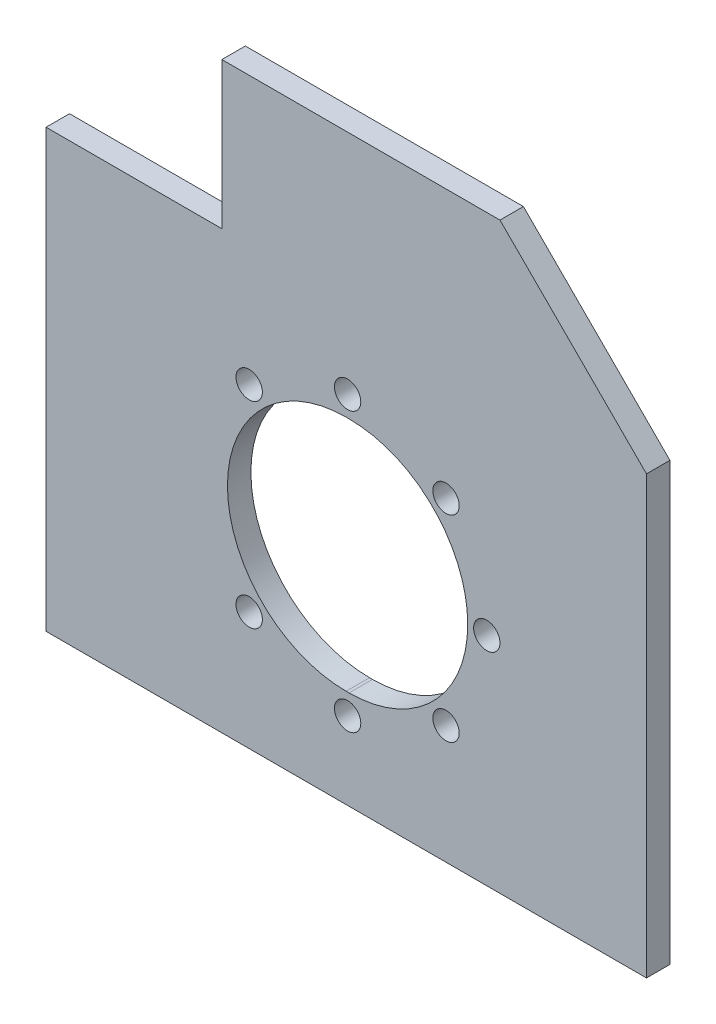
ISO-10303-21;
HEADER;
FILE_DESCRIPTION(('STEP AP214'),'2;1');
FILE_NAME('part.step','',(''),(''),'','','');
FILE_SCHEMA(('AUTOMOTIVE_DESIGN { 1 0 10303 214 1 1 1 1 }'));
ENDSEC;
DATA;
#1=APPLICATION_CONTEXT('core data for automotive mechanical design processes');
#2=APPLICATION_PROTOCOL_DEFINITION('international standard','automotive_design',2000,#1);
#3=PRODUCT_CONTEXT('',#1,'mechanical');
#4=PRODUCT('Part','Part','',(#3));
#5=PRODUCT_RELATED_PRODUCT_CATEGORY('part','',(#4));
#6=PRODUCT_DEFINITION_FORMATION('','',#4);
#7=PRODUCT_DEFINITION_CONTEXT('part definition',#1,'design');
#8=PRODUCT_DEFINITION('design','',#6,#7);
#9=PRODUCT_DEFINITION_SHAPE('','',#8);
#10=(LENGTH_UNIT() NAMED_UNIT(*) SI_UNIT(.MILLI.,.METRE.));
#11=(NAMED_UNIT(*) PLANE_ANGLE_UNIT() SI_UNIT($,.RADIAN.));
#12=(NAMED_UNIT(*) SI_UNIT($,.STERADIAN.) SOLID_ANGLE_UNIT());
#13=UNCERTAINTY_MEASURE_WITH_UNIT(LENGTH_MEASURE(1.E-05),#10,'distance_accuracy_value','');
#14=(GEOMETRIC_REPRESENTATION_CONTEXT(3) GLOBAL_UNCERTAINTY_ASSIGNED_CONTEXT((#13)) GLOBAL_UNIT_ASSIGNED_CONTEXT((#10,
#11,#12)) REPRESENTATION_CONTEXT('',''));
#15=CARTESIAN_POINT('',(0.,0.,0.));
#16=DIRECTION('',(0.,0.,1.));
#17=DIRECTION('',(1.,0.,0.));
#18=AXIS2_PLACEMENT_3D('',#15,#16,#17);
#19=CARTESIAN_POINT('',(0.,0.,-467.));
#20=DIRECTION('',(0.,0.,-1.));
#21=DIRECTION('',(-1.,0.,0.));
#22=AXIS2_PLACEMENT_3D('',#19,#20,#21);
#23=PLANE('',#22);
#24=DIRECTION('',(-1.,0.,0.));
#25=VECTOR('',#24,1.);
#26=CARTESIAN_POINT('',(335.,1060.,-467.));
#27=LINE('',#26,#25);
#28=CARTESIAN_POINT('',(429.899999999999,1060.,-467.));
#29=VERTEX_POINT('',#28);
#30=CARTESIAN_POINT('',(335.,1060.,-467.));
#31=VERTEX_POINT('',#30);
#32=EDGE_CURVE('E159',#29,#31,#27,.T.);
#33=ORIENTED_EDGE('',*,*,#32,.T.);
#34=DIRECTION('',(0.,-1.,0.));
#35=VECTOR('',#34,1.);
#36=CARTESIAN_POINT('',(335.,1010.,-467.));
#37=LINE('',#36,#35);
#38=CARTESIAN_POINT('',(335.,1010.,-467.));
#39=VERTEX_POINT('',#38);
#40=EDGE_CURVE('E162',#31,#39,#37,.T.);
#41=ORIENTED_EDGE('',*,*,#40,.T.);
#42=DIRECTION('',(-1.,0.,0.));
#43=VECTOR('',#42,1.);
#44=CARTESIAN_POINT('',(335.,1010.,-467.));
#45=LINE('',#44,#43);
#46=CARTESIAN_POINT('',(275.,1010.,-467.));
#47=VERTEX_POINT('',#46);
#48=EDGE_CURVE('E165',#39,#47,#45,.T.);
#49=ORIENTED_EDGE('',*,*,#48,.T.);
#50=DIRECTION('',(0.,-1.,0.));
#51=VECTOR('',#50,1.);
#52=CARTESIAN_POINT('',(275.,1010.,-467.));
#53=LINE('',#52,#51);
#54=CARTESIAN_POINT('',(275.,861.,-467.));
#55=VERTEX_POINT('',#54);
#56=EDGE_CURVE('E167',#47,#55,#53,.T.);
#57=ORIENTED_EDGE('',*,*,#56,.T.);
#58=DIRECTION('',(1.,0.,0.));
#59=VECTOR('',#58,1.);
#60=CARTESIAN_POINT('',(479.9,861.,-467.));
#61=LINE('',#60,#59);
#62=CARTESIAN_POINT('',(479.9,861.,-467.));
#63=VERTEX_POINT('',#62);
#64=EDGE_CURVE('E169',#55,#63,#61,.T.);
#65=ORIENTED_EDGE('',*,*,#64,.T.);
#66=DIRECTION('',(0.,1.,0.));
#67=VECTOR('',#66,1.);
#68=CARTESIAN_POINT('',(479.9,1010.,-467.));
#69=LINE('',#68,#67);
#70=CARTESIAN_POINT('',(479.9,1010.,-467.));
#71=VERTEX_POINT('',#70);
#72=EDGE_CURVE('E171',#63,#71,#69,.T.);
#73=ORIENTED_EDGE('',*,*,#72,.T.);
#74=DIRECTION('',(-0.707106781186551,0.707106781186544,0.));
#75=VECTOR('',#74,1.);
#76=CARTESIAN_POINT('',(429.899999999999,1060.,-467.));
#77=LINE('',#76,#75);
#78=EDGE_CURVE('E173',#71,#29,#77,.T.);
#79=ORIENTED_EDGE('',*,*,#78,.T.);
#80=EDGE_LOOP('',(#33,#41,#49,#57,#65,#73,#79));
#81=FACE_BOUND('',#80,.T.);
#82=CARTESIAN_POINT('',(377.4,935.,-467.));
#83=DIRECTION('',(0.,0.,1.));
#84=DIRECTION('',(1.,0.,0.));
#85=AXIS2_PLACEMENT_3D('',#82,#83,#84);
#86=CIRCLE('',#85,40.5000000000002);
#87=CARTESIAN_POINT('',(377.4,975.5,-467.));
#88=VERTEX_POINT('',#87);
#89=CARTESIAN_POINT('',(377.4,894.5,-467.));
#90=VERTEX_POINT('',#89);
#91=EDGE_CURVE('E120',#88,#90,#86,.T.);
#92=ORIENTED_EDGE('',*,*,#91,.F.);
#93=DIRECTION('',(-1.,0.,0.));
#94=VECTOR('',#93,1.);
#95=CARTESIAN_POINT('',(377.4,975.5,-467.));
#96=LINE('',#95,#94);
#97=CARTESIAN_POINT('',(378.4,975.5,-467.));
#98=VERTEX_POINT('',#97);
#99=EDGE_CURVE('E143',#98,#88,#96,.T.);
#100=ORIENTED_EDGE('',*,*,#99,.F.);
#101=CARTESIAN_POINT('',(378.4,935.,-467.));
#102=DIRECTION('',(0.,0.,1.));
#103=DIRECTION('',(1.,0.,0.));
#104=AXIS2_PLACEMENT_3D('',#101,#102,#103);
#105=CIRCLE('',#104,40.5000000000002);
#106=CARTESIAN_POINT('',(378.4,894.5,-467.));
#107=VERTEX_POINT('',#106);
#108=EDGE_CURVE('E141',#107,#98,#105,.T.);
#109=ORIENTED_EDGE('',*,*,#108,.F.);
#110=DIRECTION('',(1.,0.,0.));
#111=VECTOR('',#110,1.);
#112=CARTESIAN_POINT('',(377.4,894.5,-467.));
#113=LINE('',#112,#111);
#114=EDGE_CURVE('E128',#90,#107,#113,.T.);
#115=ORIENTED_EDGE('',*,*,#114,.F.);
#116=EDGE_LOOP('',(#92,#100,#109,#115));
#117=FACE_BOUND('',#116,.T.);
#118=CARTESIAN_POINT('',(425.4,935.,-467.));
#119=DIRECTION('',(0.,0.,1.));
#120=DIRECTION('',(1.,0.,0.));
#121=AXIS2_PLACEMENT_3D('',#118,#119,#120);
#122=CIRCLE('',#121,4.50000000000002);
#123=CARTESIAN_POINT('',(429.9,935.,-467.));
#124=VERTEX_POINT('',#123);
#125=EDGE_CURVE('E149',#124,#124,#122,.T.);
#126=ORIENTED_EDGE('',*,*,#125,.F.);
#127=EDGE_LOOP('',(#126));
#128=FACE_BOUND('',#127,.T.);
#129=CARTESIAN_POINT('',(411.487572106361,901.412427893639,-467.));
#130=DIRECTION('',(0.,0.,1.));
#131=DIRECTION('',(1.,0.,0.));
#132=AXIS2_PLACEMENT_3D('',#129,#130,#131);
#133=CIRCLE('',#132,4.50000000000002);
#134=CARTESIAN_POINT('',(415.987572106361,901.412427893639,-467.));
#135=VERTEX_POINT('',#134);
#136=EDGE_CURVE('E331',#135,#135,#133,.T.);
#137=ORIENTED_EDGE('',*,*,#136,.F.);
#138=EDGE_LOOP('',(#137));
#139=FACE_BOUND('',#138,.T.);
#140=CARTESIAN_POINT('',(377.9,887.5,-467.));
#141=DIRECTION('',(0.,0.,1.));
#142=DIRECTION('',(1.,0.,0.));
#143=AXIS2_PLACEMENT_3D('',#140,#141,#142);
#144=CIRCLE('',#143,4.50000000000002);
#145=CARTESIAN_POINT('',(382.4,887.5,-467.));
#146=VERTEX_POINT('',#145);
#147=EDGE_CURVE('E325',#146,#146,#144,.T.);
#148=ORIENTED_EDGE('',*,*,#147,.F.);
#149=EDGE_LOOP('',(#148));
#150=FACE_BOUND('',#149,.T.);
#151=CARTESIAN_POINT('',(344.312427893639,901.412427893639,-467.));
#152=DIRECTION('',(0.,0.,1.));
#153=DIRECTION('',(1.,0.,0.));
#154=AXIS2_PLACEMENT_3D('',#151,#152,#153);
#155=CIRCLE('',#154,4.50000000000002);
#156=CARTESIAN_POINT('',(348.812427893639,901.412427893639,-467.));
#157=VERTEX_POINT('',#156);
#158=EDGE_CURVE('E319',#157,#157,#155,.T.);
#159=ORIENTED_EDGE('',*,*,#158,.F.);
#160=EDGE_LOOP('',(#159));
#161=FACE_BOUND('',#160,.T.);
#162=CARTESIAN_POINT('',(344.312427893639,968.587572106361,-467.));
#163=DIRECTION('',(0.,0.,1.));
#164=DIRECTION('',(1.,0.,0.));
#165=AXIS2_PLACEMENT_3D('',#162,#163,#164);
#166=CIRCLE('',#165,4.50000000000002);
#167=CARTESIAN_POINT('',(348.812427893639,968.587572106361,-467.));
#168=VERTEX_POINT('',#167);
#169=EDGE_CURVE('E313',#168,#168,#166,.T.);
#170=ORIENTED_EDGE('',*,*,#169,.F.);
#171=EDGE_LOOP('',(#170));
#172=FACE_BOUND('',#171,.T.);
#173=CARTESIAN_POINT('',(377.9,982.5,-467.));
#174=DIRECTION('',(0.,0.,1.));
#175=DIRECTION('',(1.,0.,0.));
#176=AXIS2_PLACEMENT_3D('',#173,#174,#175);
#177=CIRCLE('',#176,4.50000000000002);
#178=CARTESIAN_POINT('',(382.4,982.5,-467.));
#179=VERTEX_POINT('',#178);
#180=EDGE_CURVE('E307',#179,#179,#177,.T.);
#181=ORIENTED_EDGE('',*,*,#180,.F.);
#182=EDGE_LOOP('',(#181));
#183=FACE_BOUND('',#182,.T.);
#184=CARTESIAN_POINT('',(411.487572106361,968.587572106361,-467.));
#185=DIRECTION('',(0.,0.,1.));
#186=DIRECTION('',(1.,0.,0.));
#187=AXIS2_PLACEMENT_3D('',#184,#185,#186);
#188=CIRCLE('',#187,4.50000000000002);
#189=CARTESIAN_POINT('',(415.987572106361,968.587572106361,-467.));
#190=VERTEX_POINT('',#189);
#191=EDGE_CURVE('E298',#190,#190,#188,.T.);
#192=ORIENTED_EDGE('',*,*,#191,.F.);
#193=EDGE_LOOP('',(#192));
#194=FACE_BOUND('',#193,.T.);
#195=ADVANCED_FACE('F37',(#81,#117,#128,#139,#150,#161,#172,#183,#194),#23,.F.);
#196=CARTESIAN_POINT('',(0.,0.,-475.));
#197=DIRECTION('',(0.,0.,-1.));
#198=DIRECTION('',(-1.,0.,0.));
#199=AXIS2_PLACEMENT_3D('',#196,#197,#198);
#200=PLANE('',#199);
#201=CARTESIAN_POINT('',(377.9,982.5,-475.));
#202=DIRECTION('',(0.,0.,1.));
#203=DIRECTION('',(1.,0.,0.));
#204=AXIS2_PLACEMENT_3D('',#201,#202,#203);
#205=CIRCLE('',#204,4.50000000000002);
#206=CARTESIAN_POINT('',(382.4,982.5,-475.));
#207=VERTEX_POINT('',#206);
#208=EDGE_CURVE('E304',#207,#207,#205,.T.);
#209=ORIENTED_EDGE('',*,*,#208,.T.);
#210=EDGE_LOOP('',(#209));
#211=FACE_BOUND('',#210,.T.);
#212=CARTESIAN_POINT('',(344.312427893639,901.412427893639,-475.));
#213=DIRECTION('',(0.,0.,1.));
#214=DIRECTION('',(1.,0.,0.));
#215=AXIS2_PLACEMENT_3D('',#212,#213,#214);
#216=CIRCLE('',#215,4.50000000000002);
#217=CARTESIAN_POINT('',(348.812427893639,901.412427893639,-475.));
#218=VERTEX_POINT('',#217);
#219=EDGE_CURVE('E316',#218,#218,#216,.T.);
#220=ORIENTED_EDGE('',*,*,#219,.T.);
#221=EDGE_LOOP('',(#220));
#222=FACE_BOUND('',#221,.T.);
#223=CARTESIAN_POINT('',(411.487572106361,901.412427893639,-475.));
#224=DIRECTION('',(0.,0.,1.));
#225=DIRECTION('',(1.,0.,0.));
#226=AXIS2_PLACEMENT_3D('',#223,#224,#225);
#227=CIRCLE('',#226,4.50000000000002);
#228=CARTESIAN_POINT('',(415.987572106361,901.412427893639,-475.));
#229=VERTEX_POINT('',#228);
#230=EDGE_CURVE('E328',#229,#229,#227,.T.);
#231=ORIENTED_EDGE('',*,*,#230,.T.);
#232=EDGE_LOOP('',(#231));
#233=FACE_BOUND('',#232,.T.);
#234=DIRECTION('',(-1.,0.,0.));
#235=VECTOR('',#234,1.);
#236=CARTESIAN_POINT('',(377.4,975.5,-475.));
#237=LINE('',#236,#235);
#238=CARTESIAN_POINT('',(378.4,975.5,-475.));
#239=VERTEX_POINT('',#238);
#240=CARTESIAN_POINT('',(377.4,975.5,-475.));
#241=VERTEX_POINT('',#240);
#242=EDGE_CURVE('E129',#239,#241,#237,.T.);
#243=ORIENTED_EDGE('',*,*,#242,.T.);
#244=CARTESIAN_POINT('',(377.4,935.,-475.));
#245=DIRECTION('',(0.,0.,1.));
#246=DIRECTION('',(1.,0.,0.));
#247=AXIS2_PLACEMENT_3D('',#244,#245,#246);
#248=CIRCLE('',#247,40.5000000000002);
#249=CARTESIAN_POINT('',(377.4,894.5,-475.));
#250=VERTEX_POINT('',#249);
#251=EDGE_CURVE('E60',#241,#250,#248,.T.);
#252=ORIENTED_EDGE('',*,*,#251,.T.);
#253=DIRECTION('',(1.,0.,0.));
#254=VECTOR('',#253,1.);
#255=CARTESIAN_POINT('',(377.4,894.5,-475.));
#256=LINE('',#255,#254);
#257=CARTESIAN_POINT('',(378.4,894.5,-475.));
#258=VERTEX_POINT('',#257);
#259=EDGE_CURVE('E135',#250,#258,#256,.T.);
#260=ORIENTED_EDGE('',*,*,#259,.T.);
#261=CARTESIAN_POINT('',(378.4,935.,-475.));
#262=DIRECTION('',(0.,0.,1.));
#263=DIRECTION('',(1.,0.,0.));
#264=AXIS2_PLACEMENT_3D('',#261,#262,#263);
#265=CIRCLE('',#264,40.5000000000002);
#266=EDGE_CURVE('E151',#258,#239,#265,.T.);
#267=ORIENTED_EDGE('',*,*,#266,.T.);
#268=EDGE_LOOP('',(#243,#252,#260,#267));
#269=FACE_BOUND('',#268,.T.);
#270=DIRECTION('',(-1.,0.,0.));
#271=VECTOR('',#270,1.);
#272=CARTESIAN_POINT('',(335.,1060.,-475.));
#273=LINE('',#272,#271);
#274=CARTESIAN_POINT('',(429.899999999999,1060.,-475.));
#275=VERTEX_POINT('',#274);
#276=CARTESIAN_POINT('',(335.,1060.,-475.));
#277=VERTEX_POINT('',#276);
#278=EDGE_CURVE('E136',#275,#277,#273,.T.);
#279=ORIENTED_EDGE('',*,*,#278,.F.);
#280=DIRECTION('',(-0.707106781186551,0.707106781186544,0.));
#281=VECTOR('',#280,1.);
#282=CARTESIAN_POINT('',(429.899999999999,1060.,-475.));
#283=LINE('',#282,#281);
#284=CARTESIAN_POINT('',(479.9,1010.,-475.));
#285=VERTEX_POINT('',#284);
#286=EDGE_CURVE('E163',#285,#275,#283,.T.);
#287=ORIENTED_EDGE('',*,*,#286,.F.);
#288=DIRECTION('',(0.,1.,0.));
#289=VECTOR('',#288,1.);
#290=CARTESIAN_POINT('',(479.9,1010.,-475.));
#291=LINE('',#290,#289);
#292=CARTESIAN_POINT('',(479.9,861.,-475.));
#293=VERTEX_POINT('',#292);
#294=EDGE_CURVE('E186',#293,#285,#291,.T.);
#295=ORIENTED_EDGE('',*,*,#294,.F.);
#296=DIRECTION('',(1.,0.,0.));
#297=VECTOR('',#296,1.);
#298=CARTESIAN_POINT('',(479.9,861.,-475.));
#299=LINE('',#298,#297);
#300=CARTESIAN_POINT('',(275.,861.,-475.));
#301=VERTEX_POINT('',#300);
#302=EDGE_CURVE('E184',#301,#293,#299,.T.);
#303=ORIENTED_EDGE('',*,*,#302,.F.);
#304=DIRECTION('',(0.,-1.,0.));
#305=VECTOR('',#304,1.);
#306=CARTESIAN_POINT('',(275.,1010.,-475.));
#307=LINE('',#306,#305);
#308=CARTESIAN_POINT('',(275.,1010.,-475.));
#309=VERTEX_POINT('',#308);
#310=EDGE_CURVE('E182',#309,#301,#307,.T.);
#311=ORIENTED_EDGE('',*,*,#310,.F.);
#312=DIRECTION('',(-1.,0.,0.));
#313=VECTOR('',#312,1.);
#314=CARTESIAN_POINT('',(335.,1010.,-475.));
#315=LINE('',#314,#313);
#316=CARTESIAN_POINT('',(335.,1010.,-475.));
#317=VERTEX_POINT('',#316);
#318=EDGE_CURVE('E180',#317,#309,#315,.T.);
#319=ORIENTED_EDGE('',*,*,#318,.F.);
#320=DIRECTION('',(0.,-1.,0.));
#321=VECTOR('',#320,1.);
#322=CARTESIAN_POINT('',(335.,1010.,-475.));
#323=LINE('',#322,#321);
#324=EDGE_CURVE('E178',#277,#317,#323,.T.);
#325=ORIENTED_EDGE('',*,*,#324,.F.);
#326=EDGE_LOOP('',(#279,#287,#295,#303,#311,#319,#325));
#327=FACE_BOUND('',#326,.T.);
#328=CARTESIAN_POINT('',(425.4,935.,-475.));
#329=DIRECTION('',(0.,0.,1.));
#330=DIRECTION('',(1.,0.,0.));
#331=AXIS2_PLACEMENT_3D('',#328,#329,#330);
#332=CIRCLE('',#331,4.50000000000002);
#333=CARTESIAN_POINT('',(429.9,935.,-475.));
#334=VERTEX_POINT('',#333);
#335=EDGE_CURVE('E334',#334,#334,#332,.T.);
#336=ORIENTED_EDGE('',*,*,#335,.T.);
#337=EDGE_LOOP('',(#336));
#338=FACE_BOUND('',#337,.T.);
#339=CARTESIAN_POINT('',(377.9,887.5,-475.));
#340=DIRECTION('',(0.,0.,1.));
#341=DIRECTION('',(1.,0.,0.));
#342=AXIS2_PLACEMENT_3D('',#339,#340,#341);
#343=CIRCLE('',#342,4.50000000000002);
#344=CARTESIAN_POINT('',(382.4,887.5,-475.));
#345=VERTEX_POINT('',#344);
#346=EDGE_CURVE('E322',#345,#345,#343,.T.);
#347=ORIENTED_EDGE('',*,*,#346,.T.);
#348=EDGE_LOOP('',(#347));
#349=FACE_BOUND('',#348,.T.);
#350=CARTESIAN_POINT('',(344.312427893639,968.587572106361,-475.));
#351=DIRECTION('',(0.,0.,1.));
#352=DIRECTION('',(1.,0.,0.));
#353=AXIS2_PLACEMENT_3D('',#350,#351,#352);
#354=CIRCLE('',#353,4.50000000000002);
#355=CARTESIAN_POINT('',(348.812427893639,968.587572106361,-475.));
#356=VERTEX_POINT('',#355);
#357=EDGE_CURVE('E310',#356,#356,#354,.T.);
#358=ORIENTED_EDGE('',*,*,#357,.T.);
#359=EDGE_LOOP('',(#358));
#360=FACE_BOUND('',#359,.T.);
#361=CARTESIAN_POINT('',(411.487572106361,968.587572106361,-475.));
#362=DIRECTION('',(0.,0.,1.));
#363=DIRECTION('',(1.,0.,0.));
#364=AXIS2_PLACEMENT_3D('',#361,#362,#363);
#365=CIRCLE('',#364,4.50000000000002);
#366=CARTESIAN_POINT('',(415.987572106361,968.587572106361,-475.));
#367=VERTEX_POINT('',#366);
#368=EDGE_CURVE('E301',#367,#367,#365,.T.);
#369=ORIENTED_EDGE('',*,*,#368,.T.);
#370=EDGE_LOOP('',(#369));
#371=FACE_BOUND('',#370,.T.);
#372=ADVANCED_FACE('F213',(#211,#222,#233,#269,#327,#338,#349,#360,#371),#200,.T.);
#373=CARTESIAN_POINT('',(335.,1060.,-467.));
#374=DIRECTION('',(0.,-1.,0.));
#375=DIRECTION('',(0.,0.,-1.));
#376=AXIS2_PLACEMENT_3D('',#373,#374,#375);
#377=PLANE('',#376);
#378=ORIENTED_EDGE('',*,*,#278,.T.);
#379=DIRECTION('',(0.,0.,-1.));
#380=VECTOR('',#379,1.);
#381=CARTESIAN_POINT('',(335.,1060.,-467.));
#382=LINE('',#381,#380);
#383=EDGE_CURVE('E11',#31,#277,#382,.T.);
#384=ORIENTED_EDGE('',*,*,#383,.F.);
#385=ORIENTED_EDGE('',*,*,#32,.F.);
#386=DIRECTION('',(0.,0.,-1.));
#387=VECTOR('',#386,1.);
#388=CARTESIAN_POINT('',(429.899999999999,1060.,-467.));
#389=LINE('',#388,#387);
#390=EDGE_CURVE('E175',#29,#275,#389,.T.);
#391=ORIENTED_EDGE('',*,*,#390,.T.);
#392=EDGE_LOOP('',(#378,#384,#385,#391));
#393=FACE_BOUND('',#392,.T.);
#394=ADVANCED_FACE('F39',(#393),#377,.F.);
#395=CARTESIAN_POINT('',(335.,1010.,-467.));
#396=DIRECTION('',(1.,0.,0.));
#397=DIRECTION('',(0.,0.,-1.));
#398=AXIS2_PLACEMENT_3D('',#395,#396,#397);
#399=PLANE('',#398);
#400=ORIENTED_EDGE('',*,*,#324,.T.);
#401=DIRECTION('',(0.,0.,-1.));
#402=VECTOR('',#401,1.);
#403=CARTESIAN_POINT('',(335.,1010.,-467.));
#404=LINE('',#403,#402);
#405=EDGE_CURVE('E45',#39,#317,#404,.T.);
#406=ORIENTED_EDGE('',*,*,#405,.F.);
#407=ORIENTED_EDGE('',*,*,#40,.F.);
#408=ORIENTED_EDGE('',*,*,#383,.T.);
#409=EDGE_LOOP('',(#400,#406,#407,#408));
#410=FACE_BOUND('',#409,.T.);
#411=ADVANCED_FACE('F230',(#410),#399,.F.);
#412=CARTESIAN_POINT('',(335.,1010.,-467.));
#413=DIRECTION('',(0.,-1.,0.));
#414=DIRECTION('',(0.,0.,-1.));
#415=AXIS2_PLACEMENT_3D('',#412,#413,#414);
#416=PLANE('',#415);
#417=ORIENTED_EDGE('',*,*,#318,.T.);
#418=DIRECTION('',(0.,0.,-1.));
#419=VECTOR('',#418,1.);
#420=CARTESIAN_POINT('',(275.,1010.,-467.));
#421=LINE('',#420,#419);
#422=EDGE_CURVE('E200',#47,#309,#421,.T.);
#423=ORIENTED_EDGE('',*,*,#422,.F.);
#424=ORIENTED_EDGE('',*,*,#48,.F.);
#425=ORIENTED_EDGE('',*,*,#405,.T.);
#426=EDGE_LOOP('',(#417,#423,#424,#425));
#427=FACE_BOUND('',#426,.T.);
#428=ADVANCED_FACE('F207',(#427),#416,.F.);
#429=CARTESIAN_POINT('',(275.,1010.,-467.));
#430=DIRECTION('',(1.,0.,0.));
#431=DIRECTION('',(0.,0.,-1.));
#432=AXIS2_PLACEMENT_3D('',#429,#430,#431);
#433=PLANE('',#432);
#434=ORIENTED_EDGE('',*,*,#310,.T.);
#435=DIRECTION('',(0.,0.,-1.));
#436=VECTOR('',#435,1.);
#437=CARTESIAN_POINT('',(275.,861.,-467.));
#438=LINE('',#437,#436);
#439=EDGE_CURVE('E197',#55,#301,#438,.T.);
#440=ORIENTED_EDGE('',*,*,#439,.F.);
#441=ORIENTED_EDGE('',*,*,#56,.F.);
#442=ORIENTED_EDGE('',*,*,#422,.T.);
#443=EDGE_LOOP('',(#434,#440,#441,#442));
#444=FACE_BOUND('',#443,.T.);
#445=ADVANCED_FACE('F219',(#444),#433,.F.);
#446=CARTESIAN_POINT('',(479.9,861.,-467.));
#447=DIRECTION('',(0.,1.,0.));
#448=DIRECTION('',(0.,0.,1.));
#449=AXIS2_PLACEMENT_3D('',#446,#447,#448);
#450=PLANE('',#449);
#451=ORIENTED_EDGE('',*,*,#302,.T.);
#452=DIRECTION('',(0.,0.,-1.));
#453=VECTOR('',#452,1.);
#454=CARTESIAN_POINT('',(479.9,861.,-467.));
#455=LINE('',#454,#453);
#456=EDGE_CURVE('E194',#63,#293,#455,.T.);
#457=ORIENTED_EDGE('',*,*,#456,.F.);
#458=ORIENTED_EDGE('',*,*,#64,.F.);
#459=ORIENTED_EDGE('',*,*,#439,.T.);
#460=EDGE_LOOP('',(#451,#457,#458,#459));
#461=FACE_BOUND('',#460,.T.);
#462=ADVANCED_FACE('F223',(#461),#450,.F.);
#463=CARTESIAN_POINT('',(479.9,1010.,-467.));
#464=DIRECTION('',(-1.,0.,0.));
#465=DIRECTION('',(0.,0.,1.));
#466=AXIS2_PLACEMENT_3D('',#463,#464,#465);
#467=PLANE('',#466);
#468=ORIENTED_EDGE('',*,*,#294,.T.);
#469=DIRECTION('',(0.,0.,-1.));
#470=VECTOR('',#469,1.);
#471=CARTESIAN_POINT('',(479.9,1010.,-467.));
#472=LINE('',#471,#470);
#473=EDGE_CURVE('E191',#71,#285,#472,.T.);
#474=ORIENTED_EDGE('',*,*,#473,.F.);
#475=ORIENTED_EDGE('',*,*,#72,.F.);
#476=ORIENTED_EDGE('',*,*,#456,.T.);
#477=EDGE_LOOP('',(#468,#474,#475,#476));
#478=FACE_BOUND('',#477,.T.);
#479=ADVANCED_FACE('F238',(#478),#467,.F.);
#480=CARTESIAN_POINT('',(429.899999999999,1060.,-467.));
#481=DIRECTION('',(-0.707106781186544,-0.707106781186552,0.));
#482=DIRECTION('',(0.707106781186552,-0.707106781186544,0.));
#483=AXIS2_PLACEMENT_3D('',#480,#481,#482);
#484=PLANE('',#483);
#485=ORIENTED_EDGE('',*,*,#286,.T.);
#486=ORIENTED_EDGE('',*,*,#390,.F.);
#487=ORIENTED_EDGE('',*,*,#78,.F.);
#488=ORIENTED_EDGE('',*,*,#473,.T.);
#489=EDGE_LOOP('',(#485,#486,#487,#488));
#490=FACE_BOUND('',#489,.T.);
#491=ADVANCED_FACE('F235',(#490),#484,.F.);
#492=CARTESIAN_POINT('',(377.4,935.,-467.));
#493=DIRECTION('',(0.,0.,-1.));
#494=DIRECTION('',(-1.,0.,0.));
#495=AXIS2_PLACEMENT_3D('',#492,#493,#494);
#496=CYLINDRICAL_SURFACE('',#495,40.5000000000002);
#497=ORIENTED_EDGE('',*,*,#251,.F.);
#498=DIRECTION('',(0.,0.,-1.));
#499=VECTOR('',#498,1.);
#500=CARTESIAN_POINT('',(377.4,975.5,-467.));
#501=LINE('',#500,#499);
#502=EDGE_CURVE('E124',#88,#241,#501,.T.);
#503=ORIENTED_EDGE('',*,*,#502,.F.);
#504=ORIENTED_EDGE('',*,*,#91,.T.);
#505=DIRECTION('',(0.,0.,-1.));
#506=VECTOR('',#505,1.);
#507=CARTESIAN_POINT('',(377.4,894.5,-467.));
#508=LINE('',#507,#506);
#509=EDGE_CURVE('E123',#90,#250,#508,.T.);
#510=ORIENTED_EDGE('',*,*,#509,.T.);
#511=EDGE_LOOP('',(#497,#503,#504,#510));
#512=FACE_BOUND('',#511,.T.);
#513=ADVANCED_FACE('F122',(#512),#496,.F.);
#514=CARTESIAN_POINT('',(377.4,894.5,-467.));
#515=DIRECTION('',(0.,1.,0.));
#516=DIRECTION('',(0.,0.,1.));
#517=AXIS2_PLACEMENT_3D('',#514,#515,#516);
#518=PLANE('',#517);
#519=ORIENTED_EDGE('',*,*,#259,.F.);
#520=ORIENTED_EDGE('',*,*,#509,.F.);
#521=ORIENTED_EDGE('',*,*,#114,.T.);
#522=DIRECTION('',(0.,0.,-1.));
#523=VECTOR('',#522,1.);
#524=CARTESIAN_POINT('',(378.4,894.5,-467.));
#525=LINE('',#524,#523);
#526=EDGE_CURVE('E137',#107,#258,#525,.T.);
#527=ORIENTED_EDGE('',*,*,#526,.T.);
#528=EDGE_LOOP('',(#519,#520,#521,#527));
#529=FACE_BOUND('',#528,.T.);
#530=ADVANCED_FACE('F132',(#529),#518,.T.);
#531=CARTESIAN_POINT('',(378.4,935.,-467.));
#532=DIRECTION('',(0.,0.,-1.));
#533=DIRECTION('',(-1.,0.,0.));
#534=AXIS2_PLACEMENT_3D('',#531,#532,#533);
#535=CYLINDRICAL_SURFACE('',#534,40.5000000000002);
#536=ORIENTED_EDGE('',*,*,#266,.F.);
#537=ORIENTED_EDGE('',*,*,#526,.F.);
#538=ORIENTED_EDGE('',*,*,#108,.T.);
#539=DIRECTION('',(0.,0.,-1.));
#540=VECTOR('',#539,1.);
#541=CARTESIAN_POINT('',(378.4,975.5,-467.));
#542=LINE('',#541,#540);
#543=EDGE_CURVE('E52',#98,#239,#542,.T.);
#544=ORIENTED_EDGE('',*,*,#543,.T.);
#545=EDGE_LOOP('',(#536,#537,#538,#544));
#546=FACE_BOUND('',#545,.T.);
#547=ADVANCED_FACE('F259',(#546),#535,.F.);
#548=CARTESIAN_POINT('',(377.4,975.5,-467.));
#549=DIRECTION('',(0.,-1.,0.));
#550=DIRECTION('',(0.,0.,-1.));
#551=AXIS2_PLACEMENT_3D('',#548,#549,#550);
#552=PLANE('',#551);
#553=ORIENTED_EDGE('',*,*,#242,.F.);
#554=ORIENTED_EDGE('',*,*,#543,.F.);
#555=ORIENTED_EDGE('',*,*,#99,.T.);
#556=ORIENTED_EDGE('',*,*,#502,.T.);
#557=EDGE_LOOP('',(#553,#554,#555,#556));
#558=FACE_BOUND('',#557,.T.);
#559=ADVANCED_FACE('F262',(#558),#552,.T.);
#560=CARTESIAN_POINT('',(425.4,935.,-467.));
#561=DIRECTION('',(0.,0.,-1.));
#562=DIRECTION('',(-1.,0.,0.));
#563=AXIS2_PLACEMENT_3D('',#560,#561,#562);
#564=CYLINDRICAL_SURFACE('',#563,4.50000000000002);
#565=ORIENTED_EDGE('',*,*,#125,.T.);
#566=EDGE_LOOP('',(#565));
#567=FACE_BOUND('',#566,.T.);
#568=ORIENTED_EDGE('',*,*,#335,.F.);
#569=EDGE_LOOP('',(#568));
#570=FACE_BOUND('',#569,.T.);
#571=ADVANCED_FACE('F266',(#567,#570),#564,.F.);
#572=CARTESIAN_POINT('',(411.487572106361,901.412427893639,-467.));
#573=DIRECTION('',(0.,0.,-1.));
#574=DIRECTION('',(-1.,0.,0.));
#575=AXIS2_PLACEMENT_3D('',#572,#573,#574);
#576=CYLINDRICAL_SURFACE('',#575,4.50000000000002);
#577=ORIENTED_EDGE('',*,*,#136,.T.);
#578=EDGE_LOOP('',(#577));
#579=FACE_BOUND('',#578,.T.);
#580=ORIENTED_EDGE('',*,*,#230,.F.);
#581=EDGE_LOOP('',(#580));
#582=FACE_BOUND('',#581,.T.);
#583=ADVANCED_FACE('F269',(#579,#582),#576,.F.);
#584=CARTESIAN_POINT('',(377.9,887.5,-467.));
#585=DIRECTION('',(0.,0.,-1.));
#586=DIRECTION('',(-1.,0.,0.));
#587=AXIS2_PLACEMENT_3D('',#584,#585,#586);
#588=CYLINDRICAL_SURFACE('',#587,4.50000000000002);
#589=ORIENTED_EDGE('',*,*,#147,.T.);
#590=EDGE_LOOP('',(#589));
#591=FACE_BOUND('',#590,.T.);
#592=ORIENTED_EDGE('',*,*,#346,.F.);
#593=EDGE_LOOP('',(#592));
#594=FACE_BOUND('',#593,.T.);
#595=ADVANCED_FACE('F273',(#591,#594),#588,.F.);
#596=CARTESIAN_POINT('',(344.312427893639,901.412427893639,-467.));
#597=DIRECTION('',(0.,0.,-1.));
#598=DIRECTION('',(-1.,0.,0.));
#599=AXIS2_PLACEMENT_3D('',#596,#597,#598);
#600=CYLINDRICAL_SURFACE('',#599,4.50000000000002);
#601=ORIENTED_EDGE('',*,*,#158,.T.);
#602=EDGE_LOOP('',(#601));
#603=FACE_BOUND('',#602,.T.);
#604=ORIENTED_EDGE('',*,*,#219,.F.);
#605=EDGE_LOOP('',(#604));
#606=FACE_BOUND('',#605,.T.);
#607=ADVANCED_FACE('F277',(#603,#606),#600,.F.);
#608=CARTESIAN_POINT('',(344.312427893639,968.587572106361,-467.));
#609=DIRECTION('',(0.,0.,-1.));
#610=DIRECTION('',(-1.,0.,0.));
#611=AXIS2_PLACEMENT_3D('',#608,#609,#610);
#612=CYLINDRICAL_SURFACE('',#611,4.50000000000002);
#613=ORIENTED_EDGE('',*,*,#169,.T.);
#614=EDGE_LOOP('',(#613));
#615=FACE_BOUND('',#614,.T.);
#616=ORIENTED_EDGE('',*,*,#357,.F.);
#617=EDGE_LOOP('',(#616));
#618=FACE_BOUND('',#617,.T.);
#619=ADVANCED_FACE('F281',(#615,#618),#612,.F.);
#620=CARTESIAN_POINT('',(377.9,982.5,-467.));
#621=DIRECTION('',(0.,0.,-1.));
#622=DIRECTION('',(-1.,0.,0.));
#623=AXIS2_PLACEMENT_3D('',#620,#621,#622);
#624=CYLINDRICAL_SURFACE('',#623,4.50000000000002);
#625=ORIENTED_EDGE('',*,*,#180,.T.);
#626=EDGE_LOOP('',(#625));
#627=FACE_BOUND('',#626,.T.);
#628=ORIENTED_EDGE('',*,*,#208,.F.);
#629=EDGE_LOOP('',(#628));
#630=FACE_BOUND('',#629,.T.);
#631=ADVANCED_FACE('F285',(#627,#630),#624,.F.);
#632=CARTESIAN_POINT('',(411.487572106361,968.587572106361,-467.));
#633=DIRECTION('',(0.,0.,-1.));
#634=DIRECTION('',(-1.,0.,0.));
#635=AXIS2_PLACEMENT_3D('',#632,#633,#634);
#636=CYLINDRICAL_SURFACE('',#635,4.50000000000002);
#637=ORIENTED_EDGE('',*,*,#191,.T.);
#638=EDGE_LOOP('',(#637));
#639=FACE_BOUND('',#638,.T.);
#640=ORIENTED_EDGE('',*,*,#368,.F.);
#641=EDGE_LOOP('',(#640));
#642=FACE_BOUND('',#641,.T.);
#643=ADVANCED_FACE('F289',(#639,#642),#636,.F.);
#644=CLOSED_SHELL('',(#195,#372,#394,#411,#428,#445,#462,#479,#491,#513,#530,#547,#559,#571,
#583,#595,#607,#619,#631,#643));
#645=MANIFOLD_SOLID_BREP('B2',#644);
#646=ADVANCED_BREP_SHAPE_REPRESENTATION('',(#18,#645),#14);
#647=SHAPE_DEFINITION_REPRESENTATION(#9,#646);
ENDSEC;
END-ISO-10303-21;
